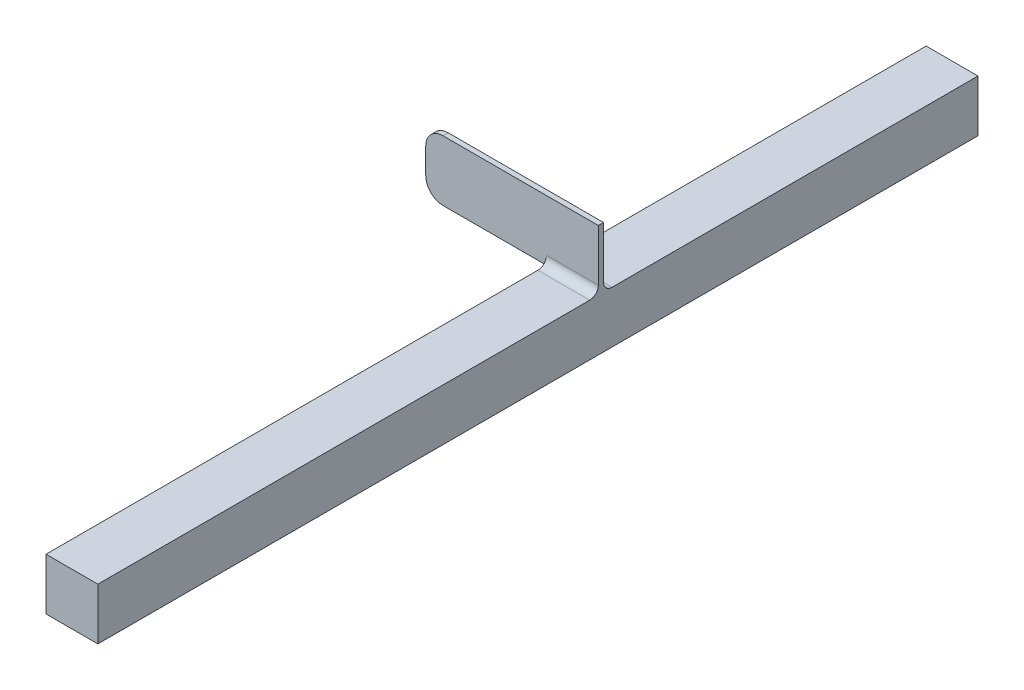
ISO-10303-21;
HEADER;
FILE_DESCRIPTION(('STEP AP214'),'2;1');
FILE_NAME('part.step','',(''),(''),'','','');
FILE_SCHEMA(('AUTOMOTIVE_DESIGN { 1 0 10303 214 1 1 1 1 }'));
ENDSEC;
DATA;
#1=APPLICATION_CONTEXT('core data for automotive mechanical design processes');
#2=APPLICATION_PROTOCOL_DEFINITION('international standard','automotive_design',2000,#1);
#3=PRODUCT_CONTEXT('',#1,'mechanical');
#4=PRODUCT('Part','Part','',(#3));
#5=PRODUCT_RELATED_PRODUCT_CATEGORY('part','',(#4));
#6=PRODUCT_DEFINITION_FORMATION('','',#4);
#7=PRODUCT_DEFINITION_CONTEXT('part definition',#1,'design');
#8=PRODUCT_DEFINITION('design','',#6,#7);
#9=PRODUCT_DEFINITION_SHAPE('','',#8);
#10=(LENGTH_UNIT() NAMED_UNIT(*) SI_UNIT(.MILLI.,.METRE.));
#11=(NAMED_UNIT(*) PLANE_ANGLE_UNIT() SI_UNIT($,.RADIAN.));
#12=(NAMED_UNIT(*) SI_UNIT($,.STERADIAN.) SOLID_ANGLE_UNIT());
#13=UNCERTAINTY_MEASURE_WITH_UNIT(LENGTH_MEASURE(1.E-05),#10,'distance_accuracy_value','');
#14=(GEOMETRIC_REPRESENTATION_CONTEXT(3) GLOBAL_UNCERTAINTY_ASSIGNED_CONTEXT((#13)) GLOBAL_UNIT_ASSIGNED_CONTEXT((#10,
#11,#12)) REPRESENTATION_CONTEXT('',''));
#15=CARTESIAN_POINT('',(0.,0.,0.));
#16=DIRECTION('',(0.,0.,1.));
#17=DIRECTION('',(1.,0.,0.));
#18=AXIS2_PLACEMENT_3D('',#15,#16,#17);
#19=CARTESIAN_POINT('',(-110.658276121753,30.,255.));
#20=DIRECTION('',(0.,-1.,0.));
#21=DIRECTION('',(0.,0.,-1.));
#22=AXIS2_PLACEMENT_3D('',#19,#20,#21);
#23=PLANE('',#22);
#24=DIRECTION('',(0.,0.,-1.));
#25=VECTOR('',#24,1.);
#26=CARTESIAN_POINT('',(-80.6128609512064,30.,255.));
#27=LINE('',#26,#25);
#28=CARTESIAN_POINT('',(-80.6128609512064,30.,255.));
#29=VERTEX_POINT('',#28);
#30=CARTESIAN_POINT('',(-80.6128609512064,30.,-29.999));
#31=VERTEX_POINT('',#30);
#32=EDGE_CURVE('E223',#29,#31,#27,.T.);
#33=ORIENTED_EDGE('',*,*,#32,.T.);
#34=DIRECTION('',(1.,0.,0.));
#35=VECTOR('',#34,1.);
#36=CARTESIAN_POINT('',(-110.658276121753,30.,-29.999));
#37=LINE('',#36,#35);
#38=CARTESIAN_POINT('',(-110.658276121753,30.,-29.999));
#39=VERTEX_POINT('',#38);
#40=EDGE_CURVE('E252',#31,#39,#37,.F.);
#41=ORIENTED_EDGE('',*,*,#40,.T.);
#42=DIRECTION('',(0.,0.,-1.));
#43=VECTOR('',#42,1.);
#44=CARTESIAN_POINT('',(-110.658276121753,30.,255.));
#45=LINE('',#44,#43);
#46=CARTESIAN_POINT('',(-110.658276121753,30.,255.));
#47=VERTEX_POINT('',#46);
#48=EDGE_CURVE('E217',#47,#39,#45,.T.);
#49=ORIENTED_EDGE('',*,*,#48,.F.);
#50=DIRECTION('',(-1.,0.,0.));
#51=VECTOR('',#50,1.);
#52=CARTESIAN_POINT('',(-110.658276121753,30.,255.));
#53=LINE('',#52,#51);
#54=EDGE_CURVE('E201',#29,#47,#53,.T.);
#55=ORIENTED_EDGE('',*,*,#54,.F.);
#56=EDGE_LOOP('',(#33,#41,#49,#55));
#57=FACE_BOUND('',#56,.T.);
#58=ADVANCED_FACE('F39',(#57),#23,.F.);
#59=CARTESIAN_POINT('',(-110.658276121753,30.,255.));
#60=DIRECTION('',(1.,0.,0.));
#61=DIRECTION('',(0.,0.,-1.));
#62=AXIS2_PLACEMENT_3D('',#59,#60,#61);
#63=PLANE('',#62);
#64=DIRECTION('',(0.,-1.,0.));
#65=VECTOR('',#64,1.);
#66=CARTESIAN_POINT('',(-110.658276121753,30.,-255.));
#67=LINE('',#66,#65);
#68=CARTESIAN_POINT('',(-110.658276121753,30.,-255.));
#69=VERTEX_POINT('',#68);
#70=CARTESIAN_POINT('',(-110.658276121753,0.,-255.));
#71=VERTEX_POINT('',#70);
#72=EDGE_CURVE('E165',#69,#71,#67,.T.);
#73=ORIENTED_EDGE('',*,*,#72,.T.);
#74=DIRECTION('',(0.,0.,-1.));
#75=VECTOR('',#74,1.);
#76=CARTESIAN_POINT('',(-110.658276121753,0.,255.));
#77=LINE('',#76,#75);
#78=CARTESIAN_POINT('',(-110.658276121753,0.,255.));
#79=VERTEX_POINT('',#78);
#80=EDGE_CURVE('E231',#79,#71,#77,.T.);
#81=ORIENTED_EDGE('',*,*,#80,.F.);
#82=DIRECTION('',(0.,-1.,0.));
#83=VECTOR('',#82,1.);
#84=CARTESIAN_POINT('',(-110.658276121753,30.,255.));
#85=LINE('',#84,#83);
#86=EDGE_CURVE('E190',#47,#79,#85,.T.);
#87=ORIENTED_EDGE('',*,*,#86,.F.);
#88=ORIENTED_EDGE('',*,*,#48,.T.);
#89=CARTESIAN_POINT('',(-110.658276121753,35.,-29.999));
#90=DIRECTION('',(1.,0.,0.));
#91=DIRECTION('',(0.,0.,-1.));
#92=AXIS2_PLACEMENT_3D('',#89,#90,#91);
#93=CIRCLE('',#92,5.);
#94=CARTESIAN_POINT('',(-110.658276121753,35.,-34.999));
#95=VERTEX_POINT('',#94);
#96=EDGE_CURVE('E264',#39,#95,#93,.T.);
#97=ORIENTED_EDGE('',*,*,#96,.T.);
#98=DIRECTION('',(0.,1.,0.));
#99=VECTOR('',#98,1.);
#100=CARTESIAN_POINT('',(-110.658276121753,0.,-34.999));
#101=LINE('',#100,#99);
#102=CARTESIAN_POINT('',(-110.658276121753,30.,-34.999));
#103=VERTEX_POINT('',#102);
#104=EDGE_CURVE('E247',#103,#95,#101,.T.);
#105=ORIENTED_EDGE('',*,*,#104,.F.);
#106=CARTESIAN_POINT('',(-110.658276121753,30.,-38.));
#107=VERTEX_POINT('',#106);
#108=EDGE_CURVE('E222',#103,#107,#45,.T.);
#109=ORIENTED_EDGE('',*,*,#108,.T.);
#110=DIRECTION('',(0.,-1.,0.));
#111=VECTOR('',#110,1.);
#112=CARTESIAN_POINT('',(-110.658276121753,30.,-38.));
#113=LINE('',#112,#111);
#114=CARTESIAN_POINT('',(-110.658276121753,35.,-38.));
#115=VERTEX_POINT('',#114);
#116=EDGE_CURVE('E239',#115,#107,#113,.T.);
#117=ORIENTED_EDGE('',*,*,#116,.F.);
#118=CARTESIAN_POINT('',(-110.658276121753,35.,-43.));
#119=DIRECTION('',(1.,0.,0.));
#120=DIRECTION('',(0.,0.,-1.));
#121=AXIS2_PLACEMENT_3D('',#118,#119,#120);
#122=CIRCLE('',#121,5.);
#123=CARTESIAN_POINT('',(-110.658276121753,30.,-43.));
#124=VERTEX_POINT('',#123);
#125=EDGE_CURVE('E258',#115,#124,#122,.T.);
#126=ORIENTED_EDGE('',*,*,#125,.T.);
#127=EDGE_CURVE('E204',#124,#69,#45,.T.);
#128=ORIENTED_EDGE('',*,*,#127,.T.);
#129=EDGE_LOOP('',(#73,#81,#87,#88,#97,#105,#109,#117,#126,#128));
#130=FACE_BOUND('',#129,.T.);
#131=ADVANCED_FACE('F301',(#130),#63,.F.);
#132=CARTESIAN_POINT('',(-110.658276121753,0.,255.));
#133=DIRECTION('',(0.,1.,0.));
#134=DIRECTION('',(0.,0.,1.));
#135=AXIS2_PLACEMENT_3D('',#132,#133,#134);
#136=PLANE('',#135);
#137=DIRECTION('',(1.,0.,0.));
#138=VECTOR('',#137,1.);
#139=CARTESIAN_POINT('',(-110.658276121753,0.,-255.));
#140=LINE('',#139,#138);
#141=CARTESIAN_POINT('',(-80.6128609512064,0.,-255.));
#142=VERTEX_POINT('',#141);
#143=EDGE_CURVE('E208',#71,#142,#140,.T.);
#144=ORIENTED_EDGE('',*,*,#143,.T.);
#145=DIRECTION('',(0.,0.,-1.));
#146=VECTOR('',#145,1.);
#147=CARTESIAN_POINT('',(-80.6128609512064,0.,255.));
#148=LINE('',#147,#146);
#149=CARTESIAN_POINT('',(-80.6128609512064,0.,255.));
#150=VERTEX_POINT('',#149);
#151=EDGE_CURVE('E227',#150,#142,#148,.T.);
#152=ORIENTED_EDGE('',*,*,#151,.F.);
#153=DIRECTION('',(1.,0.,0.));
#154=VECTOR('',#153,1.);
#155=CARTESIAN_POINT('',(-110.658276121753,0.,255.));
#156=LINE('',#155,#154);
#157=EDGE_CURVE('E194',#79,#150,#156,.T.);
#158=ORIENTED_EDGE('',*,*,#157,.F.);
#159=ORIENTED_EDGE('',*,*,#80,.T.);
#160=EDGE_LOOP('',(#144,#152,#158,#159));
#161=FACE_BOUND('',#160,.T.);
#162=ADVANCED_FACE('F315',(#161),#136,.F.);
#163=CARTESIAN_POINT('',(-80.6128609512064,30.,255.));
#164=DIRECTION('',(-1.,0.,0.));
#165=DIRECTION('',(0.,0.,1.));
#166=AXIS2_PLACEMENT_3D('',#163,#164,#165);
#167=PLANE('',#166);
#168=DIRECTION('',(0.,1.,0.));
#169=VECTOR('',#168,1.);
#170=CARTESIAN_POINT('',(-80.6128609512064,30.,-255.));
#171=LINE('',#170,#169);
#172=CARTESIAN_POINT('',(-80.6128609512064,30.,-255.));
#173=VERTEX_POINT('',#172);
#174=EDGE_CURVE('E211',#142,#173,#171,.T.);
#175=ORIENTED_EDGE('',*,*,#174,.T.);
#176=CARTESIAN_POINT('',(-80.6128609512064,30.,-43.));
#177=VERTEX_POINT('',#176);
#178=EDGE_CURVE('E221',#177,#173,#27,.T.);
#179=ORIENTED_EDGE('',*,*,#178,.F.);
#180=CARTESIAN_POINT('',(-80.6128609512064,35.,-43.));
#181=DIRECTION('',(-1.,0.,0.));
#182=DIRECTION('',(0.,0.,1.));
#183=AXIS2_PLACEMENT_3D('',#180,#181,#182);
#184=CIRCLE('',#183,5.);
#185=CARTESIAN_POINT('',(-80.6128609512064,35.,-38.));
#186=VERTEX_POINT('',#185);
#187=EDGE_CURVE('E255',#177,#186,#184,.T.);
#188=ORIENTED_EDGE('',*,*,#187,.T.);
#189=DIRECTION('',(0.,1.,0.));
#190=VECTOR('',#189,1.);
#191=CARTESIAN_POINT('',(-80.6128609512064,30.,-38.));
#192=LINE('',#191,#190);
#193=CARTESIAN_POINT('',(-80.6128609512064,65.,-38.));
#194=VERTEX_POINT('',#193);
#195=EDGE_CURVE('E162',#186,#194,#192,.T.);
#196=ORIENTED_EDGE('',*,*,#195,.T.);
#197=DIRECTION('',(0.,0.,1.));
#198=VECTOR('',#197,1.);
#199=CARTESIAN_POINT('',(-80.6128609512064,65.,-38.));
#200=LINE('',#199,#198);
#201=CARTESIAN_POINT('',(-80.6128609512064,65.,-34.999));
#202=VERTEX_POINT('',#201);
#203=EDGE_CURVE('E158',#194,#202,#200,.T.);
#204=ORIENTED_EDGE('',*,*,#203,.T.);
#205=DIRECTION('',(0.,1.,0.));
#206=VECTOR('',#205,1.);
#207=CARTESIAN_POINT('',(-80.6128609512064,30.,-34.999));
#208=LINE('',#207,#206);
#209=CARTESIAN_POINT('',(-80.6128609512064,35.,-34.999));
#210=VERTEX_POINT('',#209);
#211=EDGE_CURVE('E145',#210,#202,#208,.T.);
#212=ORIENTED_EDGE('',*,*,#211,.F.);
#213=CARTESIAN_POINT('',(-80.6128609512064,35.,-29.999));
#214=DIRECTION('',(-1.,0.,0.));
#215=DIRECTION('',(0.,0.,1.));
#216=AXIS2_PLACEMENT_3D('',#213,#214,#215);
#217=CIRCLE('',#216,5.);
#218=EDGE_CURVE('E261',#210,#31,#217,.T.);
#219=ORIENTED_EDGE('',*,*,#218,.T.);
#220=ORIENTED_EDGE('',*,*,#32,.F.);
#221=DIRECTION('',(0.,1.,0.));
#222=VECTOR('',#221,1.);
#223=CARTESIAN_POINT('',(-80.6128609512064,30.,255.));
#224=LINE('',#223,#222);
#225=EDGE_CURVE('E198',#150,#29,#224,.T.);
#226=ORIENTED_EDGE('',*,*,#225,.F.);
#227=ORIENTED_EDGE('',*,*,#151,.T.);
#228=EDGE_LOOP('',(#175,#179,#188,#196,#204,#212,#219,#220,#226,#227));
#229=FACE_BOUND('',#228,.T.);
#230=ADVANCED_FACE('F160',(#229),#167,.F.);
#231=ORIENTED_EDGE('',*,*,#127,.F.);
#232=DIRECTION('',(1.,0.,0.));
#233=VECTOR('',#232,1.);
#234=CARTESIAN_POINT('',(-80.6128609512064,30.,-43.));
#235=LINE('',#234,#233);
#236=EDGE_CURVE('E235',#124,#177,#235,.T.);
#237=ORIENTED_EDGE('',*,*,#236,.T.);
#238=ORIENTED_EDGE('',*,*,#178,.T.);
#239=DIRECTION('',(-1.,0.,0.));
#240=VECTOR('',#239,1.);
#241=CARTESIAN_POINT('',(-110.658276121753,30.,-255.));
#242=LINE('',#241,#240);
#243=EDGE_CURVE('E195',#173,#69,#242,.T.);
#244=ORIENTED_EDGE('',*,*,#243,.T.);
#245=EDGE_LOOP('',(#231,#237,#238,#244));
#246=FACE_BOUND('',#245,.T.);
#247=ADVANCED_FACE('F308',(#246),#23,.F.);
#248=CARTESIAN_POINT('',(0.,0.,255.));
#249=DIRECTION('',(0.,0.,1.));
#250=DIRECTION('',(1.,0.,0.));
#251=AXIS2_PLACEMENT_3D('',#248,#249,#250);
#252=PLANE('',#251);
#253=ORIENTED_EDGE('',*,*,#86,.T.);
#254=ORIENTED_EDGE('',*,*,#157,.T.);
#255=ORIENTED_EDGE('',*,*,#225,.T.);
#256=ORIENTED_EDGE('',*,*,#54,.T.);
#257=EDGE_LOOP('',(#253,#254,#255,#256));
#258=FACE_BOUND('',#257,.T.);
#259=ADVANCED_FACE('F320',(#258),#252,.T.);
#260=CARTESIAN_POINT('',(0.,0.,-255.));
#261=DIRECTION('',(0.,0.,1.));
#262=DIRECTION('',(1.,0.,0.));
#263=AXIS2_PLACEMENT_3D('',#260,#261,#262);
#264=PLANE('',#263);
#265=ORIENTED_EDGE('',*,*,#72,.F.);
#266=ORIENTED_EDGE('',*,*,#243,.F.);
#267=ORIENTED_EDGE('',*,*,#174,.F.);
#268=ORIENTED_EDGE('',*,*,#143,.F.);
#269=EDGE_LOOP('',(#265,#266,#267,#268));
#270=FACE_BOUND('',#269,.T.);
#271=ADVANCED_FACE('F312',(#270),#264,.F.);
#272=CARTESIAN_POINT('',(-80.6128609512064,30.,-38.));
#273=DIRECTION('',(0.,-1.,0.));
#274=DIRECTION('',(1.,0.,0.));
#275=AXIS2_PLACEMENT_3D('',#272,#273,#274);
#276=PLANE('',#275);
#277=DIRECTION('',(1.,0.,0.));
#278=VECTOR('',#277,1.);
#279=CARTESIAN_POINT('',(-80.6128609512064,30.,-34.999));
#280=LINE('',#279,#278);
#281=CARTESIAN_POINT('',(-170.612860951206,30.,-34.999));
#282=VERTEX_POINT('',#281);
#283=EDGE_CURVE('E174',#282,#103,#280,.T.);
#284=ORIENTED_EDGE('',*,*,#283,.F.);
#285=DIRECTION('',(0.,0.,1.));
#286=VECTOR('',#285,1.);
#287=CARTESIAN_POINT('',(-170.612860951206,30.,-38.));
#288=LINE('',#287,#286);
#289=CARTESIAN_POINT('',(-170.612860951206,30.,-38.));
#290=VERTEX_POINT('',#289);
#291=EDGE_CURVE('E63',#282,#290,#288,.F.);
#292=ORIENTED_EDGE('',*,*,#291,.T.);
#293=DIRECTION('',(1.,0.,0.));
#294=VECTOR('',#293,1.);
#295=CARTESIAN_POINT('',(-80.6128609512064,30.,-38.));
#296=LINE('',#295,#294);
#297=EDGE_CURVE('E166',#290,#107,#296,.T.);
#298=ORIENTED_EDGE('',*,*,#297,.T.);
#299=ORIENTED_EDGE('',*,*,#108,.F.);
#300=EDGE_LOOP('',(#284,#292,#298,#299));
#301=FACE_BOUND('',#300,.T.);
#302=ADVANCED_FACE('F295',(#301),#276,.T.);
#303=CARTESIAN_POINT('',(-180.612860951206,30.,-38.));
#304=DIRECTION('',(-1.,0.,0.));
#305=DIRECTION('',(0.,0.,1.));
#306=AXIS2_PLACEMENT_3D('',#303,#304,#305);
#307=PLANE('',#306);
#308=DIRECTION('',(0.,-1.,0.));
#309=VECTOR('',#308,1.);
#310=CARTESIAN_POINT('',(-180.612860951206,30.,-38.));
#311=LINE('',#310,#309);
#312=CARTESIAN_POINT('',(-180.612860951206,55.,-38.));
#313=VERTEX_POINT('',#312);
#314=CARTESIAN_POINT('',(-180.612860951206,40.,-38.));
#315=VERTEX_POINT('',#314);
#316=EDGE_CURVE('E184',#313,#315,#311,.T.);
#317=ORIENTED_EDGE('',*,*,#316,.T.);
#318=DIRECTION('',(0.,0.,1.));
#319=VECTOR('',#318,1.);
#320=CARTESIAN_POINT('',(-180.612860951206,40.,-38.));
#321=LINE('',#320,#319);
#322=CARTESIAN_POINT('',(-180.612860951206,40.,-34.999));
#323=VERTEX_POINT('',#322);
#324=EDGE_CURVE('E270',#315,#323,#321,.T.);
#325=ORIENTED_EDGE('',*,*,#324,.T.);
#326=DIRECTION('',(0.,-1.,0.));
#327=VECTOR('',#326,1.);
#328=CARTESIAN_POINT('',(-180.612860951206,30.,-34.999));
#329=LINE('',#328,#327);
#330=CARTESIAN_POINT('',(-180.612860951206,55.,-34.999));
#331=VERTEX_POINT('',#330);
#332=EDGE_CURVE('E171',#331,#323,#329,.T.);
#333=ORIENTED_EDGE('',*,*,#332,.F.);
#334=DIRECTION('',(0.,0.,1.));
#335=VECTOR('',#334,1.);
#336=CARTESIAN_POINT('',(-180.612860951206,55.,-38.));
#337=LINE('',#336,#335);
#338=EDGE_CURVE('E267',#331,#313,#337,.F.);
#339=ORIENTED_EDGE('',*,*,#338,.T.);
#340=EDGE_LOOP('',(#317,#325,#333,#339));
#341=FACE_BOUND('',#340,.T.);
#342=ADVANCED_FACE('F289',(#341),#307,.T.);
#343=CARTESIAN_POINT('',(-80.6128609512064,65.,-38.));
#344=DIRECTION('',(0.,1.,0.));
#345=DIRECTION('',(-1.,0.,0.));
#346=AXIS2_PLACEMENT_3D('',#343,#344,#345);
#347=PLANE('',#346);
#348=DIRECTION('',(-1.,0.,0.));
#349=VECTOR('',#348,1.);
#350=CARTESIAN_POINT('',(-80.6128609512064,65.,-38.));
#351=LINE('',#350,#349);
#352=CARTESIAN_POINT('',(-170.612860951206,65.,-38.));
#353=VERTEX_POINT('',#352);
#354=EDGE_CURVE('E181',#194,#353,#351,.T.);
#355=ORIENTED_EDGE('',*,*,#354,.T.);
#356=DIRECTION('',(0.,0.,1.));
#357=VECTOR('',#356,1.);
#358=CARTESIAN_POINT('',(-170.612860951206,65.,-38.));
#359=LINE('',#358,#357);
#360=CARTESIAN_POINT('',(-170.612860951206,65.,-34.999));
#361=VERTEX_POINT('',#360);
#362=EDGE_CURVE('E11',#353,#361,#359,.T.);
#363=ORIENTED_EDGE('',*,*,#362,.T.);
#364=DIRECTION('',(-1.,0.,0.));
#365=VECTOR('',#364,1.);
#366=CARTESIAN_POINT('',(-80.6128609512064,65.,-34.999));
#367=LINE('',#366,#365);
#368=EDGE_CURVE('E150',#202,#361,#367,.T.);
#369=ORIENTED_EDGE('',*,*,#368,.F.);
#370=ORIENTED_EDGE('',*,*,#203,.F.);
#371=EDGE_LOOP('',(#355,#363,#369,#370));
#372=FACE_BOUND('',#371,.T.);
#373=ADVANCED_FACE('F168',(#372),#347,.T.);
#374=CARTESIAN_POINT('',(0.,0.,-38.));
#375=DIRECTION('',(0.,0.,1.));
#376=DIRECTION('',(1.,0.,0.));
#377=AXIS2_PLACEMENT_3D('',#374,#375,#376);
#378=PLANE('',#377);
#379=ORIENTED_EDGE('',*,*,#297,.F.);
#380=CARTESIAN_POINT('',(-170.612860951206,40.,-38.));
#381=DIRECTION('',(0.,0.,1.));
#382=DIRECTION('',(1.,0.,0.));
#383=AXIS2_PLACEMENT_3D('',#380,#381,#382);
#384=CIRCLE('',#383,10.);
#385=EDGE_CURVE('E48',#290,#315,#384,.F.);
#386=ORIENTED_EDGE('',*,*,#385,.T.);
#387=ORIENTED_EDGE('',*,*,#316,.F.);
#388=CARTESIAN_POINT('',(-170.612860951206,55.,-38.));
#389=DIRECTION('',(0.,0.,1.));
#390=DIRECTION('',(1.,0.,0.));
#391=AXIS2_PLACEMENT_3D('',#388,#389,#390);
#392=CIRCLE('',#391,10.);
#393=EDGE_CURVE('E55',#313,#353,#392,.F.);
#394=ORIENTED_EDGE('',*,*,#393,.T.);
#395=ORIENTED_EDGE('',*,*,#354,.F.);
#396=ORIENTED_EDGE('',*,*,#195,.F.);
#397=DIRECTION('',(1.,0.,0.));
#398=VECTOR('',#397,1.);
#399=CARTESIAN_POINT('',(-110.658276121753,35.,-38.));
#400=LINE('',#399,#398);
#401=EDGE_CURVE('E243',#186,#115,#400,.F.);
#402=ORIENTED_EDGE('',*,*,#401,.T.);
#403=ORIENTED_EDGE('',*,*,#116,.T.);
#404=EDGE_LOOP('',(#379,#386,#387,#394,#395,#396,#402,#403));
#405=FACE_BOUND('',#404,.T.);
#406=ADVANCED_FACE('F285',(#405),#378,.F.);
#407=CARTESIAN_POINT('',(0.,0.,-34.999));
#408=DIRECTION('',(0.,0.,1.));
#409=DIRECTION('',(1.,0.,0.));
#410=AXIS2_PLACEMENT_3D('',#407,#408,#409);
#411=PLANE('',#410);
#412=ORIENTED_EDGE('',*,*,#332,.T.);
#413=CARTESIAN_POINT('',(-170.612860951206,40.,-34.999));
#414=DIRECTION('',(0.,0.,1.));
#415=DIRECTION('',(1.,0.,0.));
#416=AXIS2_PLACEMENT_3D('',#413,#414,#415);
#417=CIRCLE('',#416,10.);
#418=EDGE_CURVE('E277',#323,#282,#417,.T.);
#419=ORIENTED_EDGE('',*,*,#418,.T.);
#420=ORIENTED_EDGE('',*,*,#283,.T.);
#421=ORIENTED_EDGE('',*,*,#104,.T.);
#422=DIRECTION('',(1.,0.,0.));
#423=VECTOR('',#422,1.);
#424=CARTESIAN_POINT('',(0.,35.,-34.999));
#425=LINE('',#424,#423);
#426=EDGE_CURVE('E153',#95,#210,#425,.T.);
#427=ORIENTED_EDGE('',*,*,#426,.T.);
#428=ORIENTED_EDGE('',*,*,#211,.T.);
#429=ORIENTED_EDGE('',*,*,#368,.T.);
#430=CARTESIAN_POINT('',(-170.612860951206,55.,-34.999));
#431=DIRECTION('',(0.,0.,1.));
#432=DIRECTION('',(1.,0.,0.));
#433=AXIS2_PLACEMENT_3D('',#430,#431,#432);
#434=CIRCLE('',#433,10.);
#435=EDGE_CURVE('E274',#361,#331,#434,.T.);
#436=ORIENTED_EDGE('',*,*,#435,.T.);
#437=EDGE_LOOP('',(#412,#419,#420,#421,#427,#428,#429,#436));
#438=FACE_BOUND('',#437,.T.);
#439=ADVANCED_FACE('F148',(#438),#411,.T.);
#440=CARTESIAN_POINT('',(-110.658276121753,35.,-43.));
#441=DIRECTION('',(-1.,0.,0.));
#442=DIRECTION('',(0.,0.,1.));
#443=AXIS2_PLACEMENT_3D('',#440,#441,#442);
#444=CYLINDRICAL_SURFACE('',#443,5.);
#445=ORIENTED_EDGE('',*,*,#125,.F.);
#446=ORIENTED_EDGE('',*,*,#401,.F.);
#447=ORIENTED_EDGE('',*,*,#187,.F.);
#448=ORIENTED_EDGE('',*,*,#236,.F.);
#449=EDGE_LOOP('',(#445,#446,#447,#448));
#450=FACE_BOUND('',#449,.T.);
#451=ADVANCED_FACE('F331',(#450),#444,.F.);
#452=CARTESIAN_POINT('',(0.,35.,-29.999));
#453=DIRECTION('',(1.,0.,0.));
#454=DIRECTION('',(0.,0.,-1.));
#455=AXIS2_PLACEMENT_3D('',#452,#453,#454);
#456=CYLINDRICAL_SURFACE('',#455,5.);
#457=ORIENTED_EDGE('',*,*,#96,.F.);
#458=ORIENTED_EDGE('',*,*,#40,.F.);
#459=ORIENTED_EDGE('',*,*,#218,.F.);
#460=ORIENTED_EDGE('',*,*,#426,.F.);
#461=EDGE_LOOP('',(#457,#458,#459,#460));
#462=FACE_BOUND('',#461,.T.);
#463=ADVANCED_FACE('F327',(#462),#456,.F.);
#464=CARTESIAN_POINT('',(-170.612860951206,40.,-38.));
#465=DIRECTION('',(0.,0.,1.));
#466=DIRECTION('',(1.,0.,0.));
#467=AXIS2_PLACEMENT_3D('',#464,#465,#466);
#468=CYLINDRICAL_SURFACE('',#467,10.);
#469=ORIENTED_EDGE('',*,*,#385,.F.);
#470=ORIENTED_EDGE('',*,*,#291,.F.);
#471=ORIENTED_EDGE('',*,*,#418,.F.);
#472=ORIENTED_EDGE('',*,*,#324,.F.);
#473=EDGE_LOOP('',(#469,#470,#471,#472));
#474=FACE_BOUND('',#473,.T.);
#475=ADVANCED_FACE('F292',(#474),#468,.T.);
#476=CARTESIAN_POINT('',(-170.612860951206,55.,-38.));
#477=DIRECTION('',(0.,0.,1.));
#478=DIRECTION('',(1.,0.,0.));
#479=AXIS2_PLACEMENT_3D('',#476,#477,#478);
#480=CYLINDRICAL_SURFACE('',#479,10.);
#481=ORIENTED_EDGE('',*,*,#393,.F.);
#482=ORIENTED_EDGE('',*,*,#338,.F.);
#483=ORIENTED_EDGE('',*,*,#435,.F.);
#484=ORIENTED_EDGE('',*,*,#362,.F.);
#485=EDGE_LOOP('',(#481,#482,#483,#484));
#486=FACE_BOUND('',#485,.T.);
#487=ADVANCED_FACE('F41',(#486),#480,.T.);
#488=CLOSED_SHELL('',(#58,#131,#162,#230,#247,#259,#271,#302,#342,#373,#406,#439,#451,#463,#475,#487));
#489=MANIFOLD_SOLID_BREP('B2',#488);
#490=ADVANCED_BREP_SHAPE_REPRESENTATION('',(#18,#489),#14);
#491=SHAPE_DEFINITION_REPRESENTATION(#9,#490);
ENDSEC;
END-ISO-10303-21;
